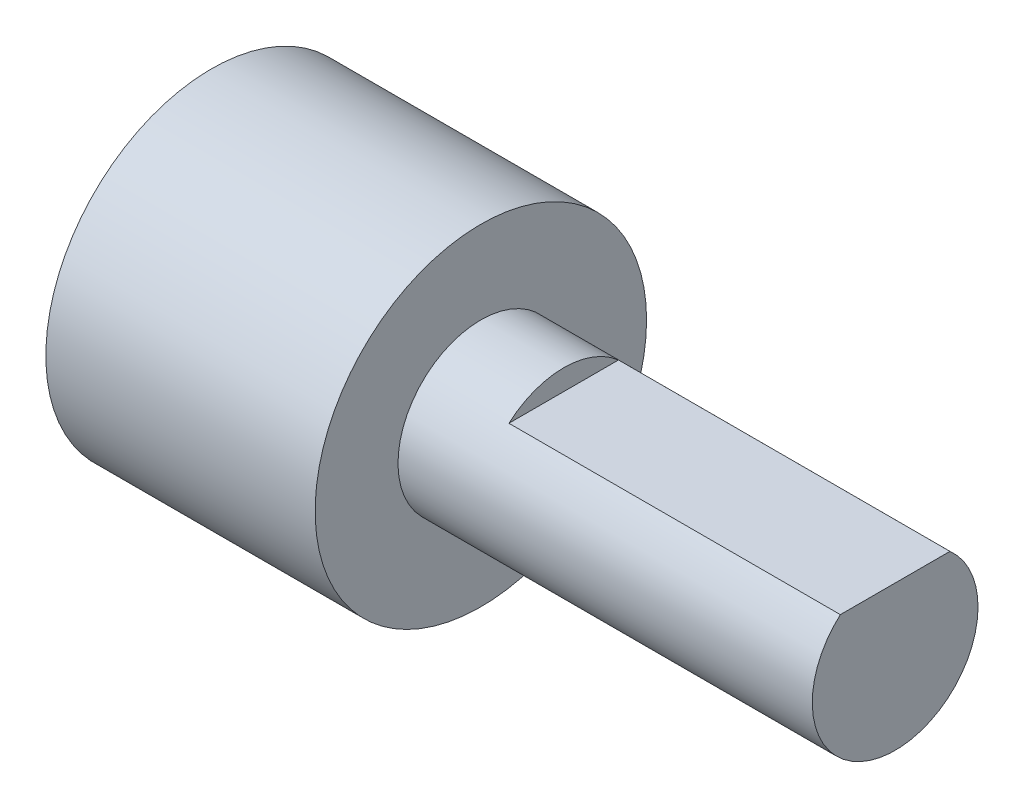
ISO-10303-21;
HEADER;
FILE_DESCRIPTION(('STEP AP214'),'2;1');
FILE_NAME('part.step','',(''),(''),'','','');
FILE_SCHEMA(('AUTOMOTIVE_DESIGN { 1 0 10303 214 1 1 1 1 }'));
ENDSEC;
DATA;
#1=APPLICATION_CONTEXT('core data for automotive mechanical design processes');
#2=APPLICATION_PROTOCOL_DEFINITION('international standard','automotive_design',2000,#1);
#3=PRODUCT_CONTEXT('',#1,'mechanical');
#4=PRODUCT('Part','Part','',(#3));
#5=PRODUCT_RELATED_PRODUCT_CATEGORY('part','',(#4));
#6=PRODUCT_DEFINITION_FORMATION('','',#4);
#7=PRODUCT_DEFINITION_CONTEXT('part definition',#1,'design');
#8=PRODUCT_DEFINITION('design','',#6,#7);
#9=PRODUCT_DEFINITION_SHAPE('','',#8);
#10=(LENGTH_UNIT() NAMED_UNIT(*) SI_UNIT(.MILLI.,.METRE.));
#11=(NAMED_UNIT(*) PLANE_ANGLE_UNIT() SI_UNIT($,.RADIAN.));
#12=(NAMED_UNIT(*) SI_UNIT($,.STERADIAN.) SOLID_ANGLE_UNIT());
#13=UNCERTAINTY_MEASURE_WITH_UNIT(LENGTH_MEASURE(1.E-05),#10,'distance_accuracy_value','');
#14=(GEOMETRIC_REPRESENTATION_CONTEXT(3) GLOBAL_UNCERTAINTY_ASSIGNED_CONTEXT((#13)) GLOBAL_UNIT_ASSIGNED_CONTEXT((#10,
#11,#12)) REPRESENTATION_CONTEXT('',''));
#15=CARTESIAN_POINT('',(0.,0.,0.));
#16=DIRECTION('',(0.,0.,1.));
#17=DIRECTION('',(1.,0.,0.));
#18=AXIS2_PLACEMENT_3D('',#15,#16,#17);
#19=CARTESIAN_POINT('',(6.5,0.,0.));
#20=DIRECTION('',(1.,0.,0.));
#21=DIRECTION('',(0.,0.,-1.));
#22=AXIS2_PLACEMENT_3D('',#19,#20,#21);
#23=PLANE('',#22);
#24=CARTESIAN_POINT('',(6.5,0.,0.));
#25=DIRECTION('',(1.,0.,0.));
#26=DIRECTION('',(0.,0.,-1.));
#27=AXIS2_PLACEMENT_3D('',#24,#25,#26);
#28=CIRCLE('',#27,4.);
#29=CARTESIAN_POINT('',(6.5,0.,-4.));
#30=VERTEX_POINT('',#29);
#31=EDGE_CURVE('E64',#30,#30,#28,.T.);
#32=ORIENTED_EDGE('',*,*,#31,.T.);
#33=EDGE_LOOP('',(#32));
#34=FACE_BOUND('',#33,.T.);
#35=CARTESIAN_POINT('',(6.5,0.,0.));
#36=DIRECTION('',(1.,0.,0.));
#37=DIRECTION('',(0.,0.,-1.));
#38=AXIS2_PLACEMENT_3D('',#35,#36,#37);
#39=CIRCLE('',#38,2.);
#40=CARTESIAN_POINT('',(6.5,0.,-2.));
#41=VERTEX_POINT('',#40);
#42=EDGE_CURVE('E72',#41,#41,#39,.T.);
#43=ORIENTED_EDGE('',*,*,#42,.F.);
#44=EDGE_LOOP('',(#43));
#45=FACE_BOUND('',#44,.T.);
#46=ADVANCED_FACE('F33',(#34,#45),#23,.T.);
#47=CARTESIAN_POINT('',(6.5,0.,0.));
#48=DIRECTION('',(-1.,0.,0.));
#49=DIRECTION('',(0.,0.,1.));
#50=AXIS2_PLACEMENT_3D('',#47,#48,#49);
#51=CYLINDRICAL_SURFACE('',#50,4.);
#52=ORIENTED_EDGE('',*,*,#31,.F.);
#53=EDGE_LOOP('',(#52));
#54=FACE_BOUND('',#53,.T.);
#55=CARTESIAN_POINT('',(0.,0.,0.));
#56=DIRECTION('',(1.,0.,0.));
#57=DIRECTION('',(0.,0.,-1.));
#58=AXIS2_PLACEMENT_3D('',#55,#56,#57);
#59=CIRCLE('',#58,4.);
#60=CARTESIAN_POINT('',(0.,0.,-4.));
#61=VERTEX_POINT('',#60);
#62=EDGE_CURVE('E71',#61,#61,#59,.T.);
#63=ORIENTED_EDGE('',*,*,#62,.T.);
#64=EDGE_LOOP('',(#63));
#65=FACE_BOUND('',#64,.T.);
#66=ADVANCED_FACE('F35',(#54,#65),#51,.T.);
#67=CARTESIAN_POINT('',(0.,0.,0.));
#68=DIRECTION('',(1.,0.,0.));
#69=DIRECTION('',(0.,0.,-1.));
#70=AXIS2_PLACEMENT_3D('',#67,#68,#69);
#71=PLANE('',#70);
#72=ORIENTED_EDGE('',*,*,#62,.F.);
#73=EDGE_LOOP('',(#72));
#74=FACE_BOUND('',#73,.T.);
#75=ADVANCED_FACE('F87',(#74),#71,.F.);
#76=CARTESIAN_POINT('',(16.5,0.,0.));
#77=DIRECTION('',(-1.,0.,0.));
#78=DIRECTION('',(0.,0.,1.));
#79=AXIS2_PLACEMENT_3D('',#76,#77,#78);
#80=CYLINDRICAL_SURFACE('',#79,2.);
#81=CARTESIAN_POINT('',(16.5,0.,0.));
#82=DIRECTION('',(1.,0.,0.));
#83=DIRECTION('',(0.,0.,-1.));
#84=AXIS2_PLACEMENT_3D('',#81,#82,#83);
#85=CIRCLE('',#84,2.);
#86=CARTESIAN_POINT('',(16.5,1.5,1.3228756555323));
#87=VERTEX_POINT('',#86);
#88=CARTESIAN_POINT('',(16.5,1.5,-1.3228756555323));
#89=VERTEX_POINT('',#88);
#90=EDGE_CURVE('E67',#87,#89,#85,.T.);
#91=ORIENTED_EDGE('',*,*,#90,.F.);
#92=DIRECTION('',(-1.,0.,0.));
#93=VECTOR('',#92,1.);
#94=CARTESIAN_POINT('',(16.5,1.5,1.3228756555323));
#95=LINE('',#94,#93);
#96=CARTESIAN_POINT('',(8.5,1.5,1.3228756555323));
#97=VERTEX_POINT('',#96);
#98=EDGE_CURVE('E48',#87,#97,#95,.T.);
#99=ORIENTED_EDGE('',*,*,#98,.T.);
#100=CARTESIAN_POINT('',(8.5,0.,0.));
#101=DIRECTION('',(1.,0.,0.));
#102=DIRECTION('',(0.,0.,-1.));
#103=AXIS2_PLACEMENT_3D('',#100,#101,#102);
#104=CIRCLE('',#103,2.);
#105=CARTESIAN_POINT('',(8.5,1.5,-1.3228756555323));
#106=VERTEX_POINT('',#105);
#107=EDGE_CURVE('E11',#106,#97,#104,.T.);
#108=ORIENTED_EDGE('',*,*,#107,.F.);
#109=DIRECTION('',(-1.,0.,0.));
#110=VECTOR('',#109,1.);
#111=CARTESIAN_POINT('',(16.5,1.5,-1.3228756555323));
#112=LINE('',#111,#110);
#113=EDGE_CURVE('E59',#106,#89,#112,.F.);
#114=ORIENTED_EDGE('',*,*,#113,.T.);
#115=EDGE_LOOP('',(#91,#99,#108,#114));
#116=FACE_BOUND('',#115,.T.);
#117=ORIENTED_EDGE('',*,*,#42,.T.);
#118=EDGE_LOOP('',(#117));
#119=FACE_BOUND('',#118,.T.);
#120=ADVANCED_FACE('F65',(#116,#119),#80,.T.);
#121=CARTESIAN_POINT('',(16.5,0.,0.));
#122=DIRECTION('',(1.,0.,0.));
#123=DIRECTION('',(0.,0.,-1.));
#124=AXIS2_PLACEMENT_3D('',#121,#122,#123);
#125=PLANE('',#124);
#126=DIRECTION('',(0.,0.,-1.));
#127=VECTOR('',#126,1.);
#128=CARTESIAN_POINT('',(16.5,1.5,0.));
#129=LINE('',#128,#127);
#130=EDGE_CURVE('E41',#87,#89,#129,.T.);
#131=ORIENTED_EDGE('',*,*,#130,.F.);
#132=ORIENTED_EDGE('',*,*,#90,.T.);
#133=EDGE_LOOP('',(#131,#132));
#134=FACE_BOUND('',#133,.T.);
#135=ADVANCED_FACE('F70',(#134),#125,.T.);
#136=CARTESIAN_POINT('',(8.5,0.,0.));
#137=DIRECTION('',(1.,0.,0.));
#138=DIRECTION('',(0.,0.,-1.));
#139=AXIS2_PLACEMENT_3D('',#136,#137,#138);
#140=PLANE('',#139);
#141=DIRECTION('',(0.,0.,-1.));
#142=VECTOR('',#141,1.);
#143=CARTESIAN_POINT('',(8.5,1.5,2.));
#144=LINE('',#143,#142);
#145=EDGE_CURVE('E68',#97,#106,#144,.T.);
#146=ORIENTED_EDGE('',*,*,#145,.T.);
#147=ORIENTED_EDGE('',*,*,#107,.T.);
#148=EDGE_LOOP('',(#146,#147));
#149=FACE_BOUND('',#148,.T.);
#150=ADVANCED_FACE('F103',(#149),#140,.T.);
#151=CARTESIAN_POINT('',(8.5,1.5,2.));
#152=DIRECTION('',(0.,-1.,0.));
#153=DIRECTION('',(0.,0.,-1.));
#154=AXIS2_PLACEMENT_3D('',#151,#152,#153);
#155=PLANE('',#154);
#156=ORIENTED_EDGE('',*,*,#130,.T.);
#157=ORIENTED_EDGE('',*,*,#113,.F.);
#158=ORIENTED_EDGE('',*,*,#145,.F.);
#159=ORIENTED_EDGE('',*,*,#98,.F.);
#160=EDGE_LOOP('',(#156,#157,#158,#159));
#161=FACE_BOUND('',#160,.T.);
#162=ADVANCED_FACE('F58',(#161),#155,.F.);
#163=CLOSED_SHELL('',(#46,#66,#75,#120,#135,#150,#162));
#164=MANIFOLD_SOLID_BREP('B2',#163);
#165=ADVANCED_BREP_SHAPE_REPRESENTATION('',(#18,#164),#14);
#166=SHAPE_DEFINITION_REPRESENTATION(#9,#165);
ENDSEC;
END-ISO-10303-21;
